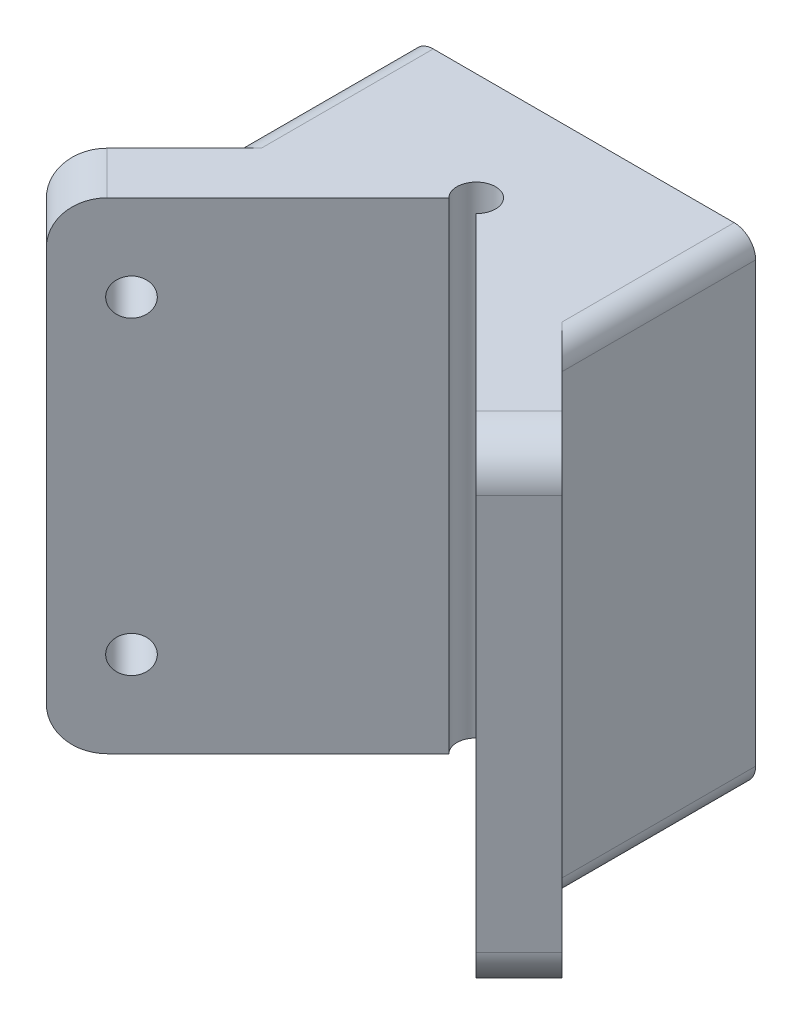
ISO-10303-21;
HEADER;
FILE_DESCRIPTION(('STEP AP214'),'2;1');
FILE_NAME('part.step','',(''),(''),'','','');
FILE_SCHEMA(('AUTOMOTIVE_DESIGN { 1 0 10303 214 1 1 1 1 }'));
ENDSEC;
DATA;
#1=APPLICATION_CONTEXT('core data for automotive mechanical design processes');
#2=APPLICATION_PROTOCOL_DEFINITION('international standard','automotive_design',2000,#1);
#3=PRODUCT_CONTEXT('',#1,'mechanical');
#4=PRODUCT('Part','Part','',(#3));
#5=PRODUCT_RELATED_PRODUCT_CATEGORY('part','',(#4));
#6=PRODUCT_DEFINITION_FORMATION('','',#4);
#7=PRODUCT_DEFINITION_CONTEXT('part definition',#1,'design');
#8=PRODUCT_DEFINITION('design','',#6,#7);
#9=PRODUCT_DEFINITION_SHAPE('','',#8);
#10=(LENGTH_UNIT() NAMED_UNIT(*) SI_UNIT(.MILLI.,.METRE.));
#11=(NAMED_UNIT(*) PLANE_ANGLE_UNIT() SI_UNIT($,.RADIAN.));
#12=(NAMED_UNIT(*) SI_UNIT($,.STERADIAN.) SOLID_ANGLE_UNIT());
#13=UNCERTAINTY_MEASURE_WITH_UNIT(LENGTH_MEASURE(1.E-05),#10,'distance_accuracy_value','');
#14=(GEOMETRIC_REPRESENTATION_CONTEXT(3) GLOBAL_UNCERTAINTY_ASSIGNED_CONTEXT((#13)) GLOBAL_UNIT_ASSIGNED_CONTEXT((#10,
#11,#12)) REPRESENTATION_CONTEXT('',''));
#15=CARTESIAN_POINT('',(0.,0.,0.));
#16=DIRECTION('',(0.,0.,1.));
#17=DIRECTION('',(1.,0.,0.));
#18=AXIS2_PLACEMENT_3D('',#15,#16,#17);
#19=CARTESIAN_POINT('',(40.,56.,100.));
#20=DIRECTION('',(-1.,0.,0.));
#21=DIRECTION('',(0.,0.,1.));
#22=AXIS2_PLACEMENT_3D('',#19,#20,#21);
#23=PLANE('',#22);
#24=DIRECTION('',(0.,1.,0.));
#25=VECTOR('',#24,1.);
#26=CARTESIAN_POINT('',(40.,56.,0.));
#27=LINE('',#26,#25);
#28=CARTESIAN_POINT('',(40.,-51.,0.));
#29=VERTEX_POINT('',#28);
#30=CARTESIAN_POINT('',(40.,51.,0.));
#31=VERTEX_POINT('',#30);
#32=EDGE_CURVE('E222',#29,#31,#27,.T.);
#33=ORIENTED_EDGE('',*,*,#32,.T.);
#34=DIRECTION('',(0.,0.,-1.));
#35=VECTOR('',#34,1.);
#36=CARTESIAN_POINT('',(40.,51.,100.));
#37=LINE('',#36,#35);
#38=CARTESIAN_POINT('',(40.,51.,45.0000000000003));
#39=VERTEX_POINT('',#38);
#40=EDGE_CURVE('E316',#31,#39,#37,.F.);
#41=ORIENTED_EDGE('',*,*,#40,.T.);
#42=DIRECTION('',(0.,-1.,0.));
#43=VECTOR('',#42,1.);
#44=CARTESIAN_POINT('',(40.,56.,45.0000000000003));
#45=LINE('',#44,#43);
#46=CARTESIAN_POINT('',(40.,-51.,45.0000000000003));
#47=VERTEX_POINT('',#46);
#48=EDGE_CURVE('E205',#39,#47,#45,.T.);
#49=ORIENTED_EDGE('',*,*,#48,.T.);
#50=DIRECTION('',(0.,0.,-1.));
#51=VECTOR('',#50,1.);
#52=CARTESIAN_POINT('',(40.,-51.,100.));
#53=LINE('',#52,#51);
#54=EDGE_CURVE('E313',#47,#29,#53,.T.);
#55=ORIENTED_EDGE('',*,*,#54,.T.);
#56=EDGE_LOOP('',(#33,#41,#49,#55));
#57=FACE_BOUND('',#56,.T.);
#58=ADVANCED_FACE('F33',(#57),#23,.F.);
#59=CARTESIAN_POINT('',(-40.,56.,100.));
#60=DIRECTION('',(0.,-1.,0.));
#61=DIRECTION('',(0.,0.,-1.));
#62=AXIS2_PLACEMENT_3D('',#59,#60,#61);
#63=PLANE('',#62);
#64=DIRECTION('',(-0.707106781186539,0.,0.707106781186556));
#65=VECTOR('',#64,1.);
#66=CARTESIAN_POINT('',(-50.,56.,74.9999999999997));
#67=LINE('',#66,#65);
#68=CARTESIAN_POINT('',(-3.18198051533943,56.,28.181980515338));
#69=VERTEX_POINT('',#68);
#70=CARTESIAN_POINT('',(-42.9289321881346,56.,67.9289321881342));
#71=VERTEX_POINT('',#70);
#72=EDGE_CURVE('E171',#69,#71,#67,.T.);
#73=ORIENTED_EDGE('',*,*,#72,.F.);
#74=CARTESIAN_POINT('',(0.,56.,24.9999999999985));
#75=DIRECTION('',(0.,1.,0.));
#76=DIRECTION('',(0.,0.,1.));
#77=AXIS2_PLACEMENT_3D('',#74,#75,#76);
#78=CIRCLE('',#77,4.5);
#79=CARTESIAN_POINT('',(3.1819805153395,56.,28.181980515338));
#80=VERTEX_POINT('',#79);
#81=EDGE_CURVE('E157',#80,#69,#78,.T.);
#82=ORIENTED_EDGE('',*,*,#81,.F.);
#83=DIRECTION('',(-0.707106781186556,0.,-0.707106781186539));
#84=VECTOR('',#83,1.);
#85=CARTESIAN_POINT('',(0.,56.,24.9999999999985));
#86=LINE('',#85,#84);
#87=CARTESIAN_POINT('',(42.9289321881356,56.,67.9289321881331));
#88=VERTEX_POINT('',#87);
#89=EDGE_CURVE('E168',#88,#80,#86,.T.);
#90=ORIENTED_EDGE('',*,*,#89,.F.);
#91=DIRECTION('',(0.707106781186545,0.,-0.70710678118655));
#92=VECTOR('',#91,1.);
#93=CARTESIAN_POINT('',(52.9289321881341,56.,57.9289321881346));
#94=LINE('',#93,#92);
#95=CARTESIAN_POINT('',(52.9289321881341,56.,57.9289321881345));
#96=VERTEX_POINT('',#95);
#97=EDGE_CURVE('E278',#88,#96,#94,.T.);
#98=ORIENTED_EDGE('',*,*,#97,.T.);
#99=DIRECTION('',(-0.707106781186545,0.,-0.70710678118655));
#100=VECTOR('',#99,1.);
#101=CARTESIAN_POINT('',(0.,56.,5.));
#102=LINE('',#101,#100);
#103=CARTESIAN_POINT('',(35.,56.,40.0000000000002));
#104=VERTEX_POINT('',#103);
#105=EDGE_CURVE('E191',#96,#104,#102,.T.);
#106=ORIENTED_EDGE('',*,*,#105,.T.);
#107=DIRECTION('',(0.,0.,-1.));
#108=VECTOR('',#107,1.);
#109=CARTESIAN_POINT('',(35.,56.,100.));
#110=LINE('',#109,#108);
#111=CARTESIAN_POINT('',(35.,56.,0.));
#112=VERTEX_POINT('',#111);
#113=EDGE_CURVE('E307',#104,#112,#110,.T.);
#114=ORIENTED_EDGE('',*,*,#113,.T.);
#115=DIRECTION('',(-1.,0.,0.));
#116=VECTOR('',#115,1.);
#117=CARTESIAN_POINT('',(-40.,56.,0.));
#118=LINE('',#117,#116);
#119=CARTESIAN_POINT('',(-35.,56.,0.));
#120=VERTEX_POINT('',#119);
#121=EDGE_CURVE('E225',#112,#120,#118,.T.);
#122=ORIENTED_EDGE('',*,*,#121,.T.);
#123=DIRECTION('',(0.,0.,-1.));
#124=VECTOR('',#123,1.);
#125=CARTESIAN_POINT('',(-35.,56.,100.));
#126=LINE('',#125,#124);
#127=CARTESIAN_POINT('',(-35.,56.,40.));
#128=VERTEX_POINT('',#127);
#129=EDGE_CURVE('E310',#120,#128,#126,.F.);
#130=ORIENTED_EDGE('',*,*,#129,.T.);
#131=DIRECTION('',(-0.707106781186547,0.,0.707106781186548));
#132=VECTOR('',#131,1.);
#133=CARTESIAN_POINT('',(-60.,56.,65.));
#134=LINE('',#133,#132);
#135=CARTESIAN_POINT('',(-52.9289321881345,56.,57.9289321881345));
#136=VERTEX_POINT('',#135);
#137=EDGE_CURVE('E196',#128,#136,#134,.T.);
#138=ORIENTED_EDGE('',*,*,#137,.T.);
#139=DIRECTION('',(0.707106781186556,0.,0.707106781186539));
#140=VECTOR('',#139,1.);
#141=CARTESIAN_POINT('',(-42.9289321881346,56.,67.9289321881342));
#142=LINE('',#141,#140);
#143=EDGE_CURVE('E276',#136,#71,#142,.T.);
#144=ORIENTED_EDGE('',*,*,#143,.T.);
#145=EDGE_LOOP('',(#73,#82,#90,#98,#106,#114,#122,#130,#138,#144));
#146=FACE_BOUND('',#145,.T.);
#147=ADVANCED_FACE('F166',(#146),#63,.F.);
#148=CARTESIAN_POINT('',(-40.,56.,100.));
#149=DIRECTION('',(1.,0.,0.));
#150=DIRECTION('',(0.,0.,-1.));
#151=AXIS2_PLACEMENT_3D('',#148,#149,#150);
#152=PLANE('',#151);
#153=DIRECTION('',(0.,1.,0.));
#154=VECTOR('',#153,1.);
#155=CARTESIAN_POINT('',(-40.,56.,45.));
#156=LINE('',#155,#154);
#157=CARTESIAN_POINT('',(-40.,-51.,45.));
#158=VERTEX_POINT('',#157);
#159=CARTESIAN_POINT('',(-40.,51.,45.));
#160=VERTEX_POINT('',#159);
#161=EDGE_CURVE('E215',#158,#160,#156,.T.);
#162=ORIENTED_EDGE('',*,*,#161,.T.);
#163=DIRECTION('',(0.,0.,-1.));
#164=VECTOR('',#163,1.);
#165=CARTESIAN_POINT('',(-40.,51.,100.));
#166=LINE('',#165,#164);
#167=CARTESIAN_POINT('',(-40.,51.,0.));
#168=VERTEX_POINT('',#167);
#169=EDGE_CURVE('E296',#160,#168,#166,.T.);
#170=ORIENTED_EDGE('',*,*,#169,.T.);
#171=DIRECTION('',(0.,-1.,0.));
#172=VECTOR('',#171,1.);
#173=CARTESIAN_POINT('',(-40.,56.,0.));
#174=LINE('',#173,#172);
#175=CARTESIAN_POINT('',(-40.,-51.,0.));
#176=VERTEX_POINT('',#175);
#177=EDGE_CURVE('E229',#168,#176,#174,.T.);
#178=ORIENTED_EDGE('',*,*,#177,.T.);
#179=DIRECTION('',(0.,0.,-1.));
#180=VECTOR('',#179,1.);
#181=CARTESIAN_POINT('',(-40.,-51.,100.));
#182=LINE('',#181,#180);
#183=EDGE_CURVE('E294',#176,#158,#182,.F.);
#184=ORIENTED_EDGE('',*,*,#183,.T.);
#185=EDGE_LOOP('',(#162,#170,#178,#184));
#186=FACE_BOUND('',#185,.T.);
#187=ADVANCED_FACE('F353',(#186),#152,.F.);
#188=CARTESIAN_POINT('',(-40.,-56.,100.));
#189=DIRECTION('',(0.,1.,0.));
#190=DIRECTION('',(0.,0.,1.));
#191=AXIS2_PLACEMENT_3D('',#188,#189,#190);
#192=PLANE('',#191);
#193=DIRECTION('',(-0.707106781186556,0.,-0.707106781186539));
#194=VECTOR('',#193,1.);
#195=CARTESIAN_POINT('',(0.,-56.,24.9999999999985));
#196=LINE('',#195,#194);
#197=CARTESIAN_POINT('',(42.9289321881356,-56.,67.9289321881331));
#198=VERTEX_POINT('',#197);
#199=CARTESIAN_POINT('',(3.1819805153395,-56.,28.181980515338));
#200=VERTEX_POINT('',#199);
#201=EDGE_CURVE('E179',#198,#200,#196,.T.);
#202=ORIENTED_EDGE('',*,*,#201,.T.);
#203=CARTESIAN_POINT('',(0.,-56.,24.9999999999985));
#204=DIRECTION('',(0.,1.,0.));
#205=DIRECTION('',(0.,0.,1.));
#206=AXIS2_PLACEMENT_3D('',#203,#204,#205);
#207=CIRCLE('',#206,4.5);
#208=CARTESIAN_POINT('',(-3.18198051533943,-56.,28.181980515338));
#209=VERTEX_POINT('',#208);
#210=EDGE_CURVE('E48',#200,#209,#207,.T.);
#211=ORIENTED_EDGE('',*,*,#210,.T.);
#212=DIRECTION('',(-0.707106781186539,0.,0.707106781186556));
#213=VECTOR('',#212,1.);
#214=CARTESIAN_POINT('',(-50.,-56.,74.9999999999997));
#215=LINE('',#214,#213);
#216=CARTESIAN_POINT('',(-42.9289321881346,-56.,67.9289321881342));
#217=VERTEX_POINT('',#216);
#218=EDGE_CURVE('E185',#209,#217,#215,.T.);
#219=ORIENTED_EDGE('',*,*,#218,.T.);
#220=DIRECTION('',(0.707106781186556,0.,0.707106781186539));
#221=VECTOR('',#220,1.);
#222=CARTESIAN_POINT('',(-52.9289321881346,-56.,57.9289321881344));
#223=LINE('',#222,#221);
#224=CARTESIAN_POINT('',(-52.9289321881345,-56.,57.9289321881345));
#225=VERTEX_POINT('',#224);
#226=EDGE_CURVE('E269',#217,#225,#223,.F.);
#227=ORIENTED_EDGE('',*,*,#226,.T.);
#228=DIRECTION('',(-0.707106781186547,0.,0.707106781186548));
#229=VECTOR('',#228,1.);
#230=CARTESIAN_POINT('',(-60.,-56.,65.));
#231=LINE('',#230,#229);
#232=CARTESIAN_POINT('',(-35.,-56.,40.));
#233=VERTEX_POINT('',#232);
#234=EDGE_CURVE('E55',#233,#225,#231,.T.);
#235=ORIENTED_EDGE('',*,*,#234,.F.);
#236=DIRECTION('',(0.,0.,-1.));
#237=VECTOR('',#236,1.);
#238=CARTESIAN_POINT('',(-35.,-56.,100.));
#239=LINE('',#238,#237);
#240=CARTESIAN_POINT('',(-35.,-56.,0.));
#241=VERTEX_POINT('',#240);
#242=EDGE_CURVE('E321',#233,#241,#239,.T.);
#243=ORIENTED_EDGE('',*,*,#242,.T.);
#244=DIRECTION('',(1.,0.,0.));
#245=VECTOR('',#244,1.);
#246=CARTESIAN_POINT('',(-40.,-56.,0.));
#247=LINE('',#246,#245);
#248=CARTESIAN_POINT('',(35.,-56.,0.));
#249=VERTEX_POINT('',#248);
#250=EDGE_CURVE('E232',#241,#249,#247,.T.);
#251=ORIENTED_EDGE('',*,*,#250,.T.);
#252=DIRECTION('',(0.,0.,-1.));
#253=VECTOR('',#252,1.);
#254=CARTESIAN_POINT('',(35.,-56.,100.));
#255=LINE('',#254,#253);
#256=CARTESIAN_POINT('',(35.,-56.,40.0000000000002));
#257=VERTEX_POINT('',#256);
#258=EDGE_CURVE('E318',#249,#257,#255,.F.);
#259=ORIENTED_EDGE('',*,*,#258,.T.);
#260=DIRECTION('',(-0.707106781186545,0.,-0.70710678118655));
#261=VECTOR('',#260,1.);
#262=CARTESIAN_POINT('',(0.,-56.,5.));
#263=LINE('',#262,#261);
#264=CARTESIAN_POINT('',(52.9289321881341,-56.,57.9289321881345));
#265=VERTEX_POINT('',#264);
#266=EDGE_CURVE('E194',#265,#257,#263,.T.);
#267=ORIENTED_EDGE('',*,*,#266,.F.);
#268=DIRECTION('',(0.707106781186545,0.,-0.70710678118655));
#269=VECTOR('',#268,1.);
#270=CARTESIAN_POINT('',(42.9289321881369,-56.,67.9289321881318));
#271=LINE('',#270,#269);
#272=EDGE_CURVE('E271',#265,#198,#271,.F.);
#273=ORIENTED_EDGE('',*,*,#272,.T.);
#274=EDGE_LOOP('',(#202,#211,#219,#227,#235,#243,#251,#259,#267,#273));
#275=FACE_BOUND('',#274,.T.);
#276=ADVANCED_FACE('F346',(#275),#192,.F.);
#277=CARTESIAN_POINT('',(0.,0.,0.));
#278=DIRECTION('',(0.,0.,1.));
#279=DIRECTION('',(1.,0.,0.));
#280=AXIS2_PLACEMENT_3D('',#277,#278,#279);
#281=PLANE('',#280);
#282=CARTESIAN_POINT('',(32.,-48.,0.));
#283=DIRECTION('',(0.,0.,1.));
#284=DIRECTION('',(1.,0.,0.));
#285=AXIS2_PLACEMENT_3D('',#282,#283,#284);
#286=CIRCLE('',#285,2.5);
#287=CARTESIAN_POINT('',(34.5,-48.,0.));
#288=VERTEX_POINT('',#287);
#289=EDGE_CURVE('E226',#288,#288,#286,.F.);
#290=ORIENTED_EDGE('',*,*,#289,.F.);
#291=EDGE_LOOP('',(#290));
#292=FACE_BOUND('',#291,.T.);
#293=CARTESIAN_POINT('',(-32.,47.9976581795832,0.));
#294=DIRECTION('',(0.,0.,1.));
#295=DIRECTION('',(1.,0.,0.));
#296=AXIS2_PLACEMENT_3D('',#293,#294,#295);
#297=CIRCLE('',#296,2.5);
#298=CARTESIAN_POINT('',(-29.5,47.9976581795832,0.));
#299=VERTEX_POINT('',#298);
#300=EDGE_CURVE('E241',#299,#299,#297,.F.);
#301=ORIENTED_EDGE('',*,*,#300,.F.);
#302=EDGE_LOOP('',(#301));
#303=FACE_BOUND('',#302,.T.);
#304=CARTESIAN_POINT('',(32.,48.,0.));
#305=DIRECTION('',(0.,0.,1.));
#306=DIRECTION('',(1.,0.,0.));
#307=AXIS2_PLACEMENT_3D('',#304,#305,#306);
#308=CIRCLE('',#307,2.5);
#309=CARTESIAN_POINT('',(34.5,48.,0.));
#310=VERTEX_POINT('',#309);
#311=EDGE_CURVE('E238',#310,#310,#308,.F.);
#312=ORIENTED_EDGE('',*,*,#311,.F.);
#313=EDGE_LOOP('',(#312));
#314=FACE_BOUND('',#313,.T.);
#315=CARTESIAN_POINT('',(-32.,-48.,0.));
#316=DIRECTION('',(0.,0.,1.));
#317=DIRECTION('',(1.,0.,0.));
#318=AXIS2_PLACEMENT_3D('',#315,#316,#317);
#319=CIRCLE('',#318,2.5);
#320=CARTESIAN_POINT('',(-29.5,-48.,0.));
#321=VERTEX_POINT('',#320);
#322=EDGE_CURVE('E221',#321,#321,#319,.F.);
#323=ORIENTED_EDGE('',*,*,#322,.F.);
#324=EDGE_LOOP('',(#323));
#325=FACE_BOUND('',#324,.T.);
#326=ORIENTED_EDGE('',*,*,#177,.F.);
#327=CARTESIAN_POINT('',(-35.,51.,0.));
#328=DIRECTION('',(0.,0.,1.));
#329=DIRECTION('',(1.,0.,0.));
#330=AXIS2_PLACEMENT_3D('',#327,#328,#329);
#331=CIRCLE('',#330,5.);
#332=EDGE_CURVE('E305',#168,#120,#331,.F.);
#333=ORIENTED_EDGE('',*,*,#332,.T.);
#334=ORIENTED_EDGE('',*,*,#121,.F.);
#335=CARTESIAN_POINT('',(35.,51.,0.));
#336=DIRECTION('',(0.,0.,1.));
#337=DIRECTION('',(1.,0.,0.));
#338=AXIS2_PLACEMENT_3D('',#335,#336,#337);
#339=CIRCLE('',#338,5.);
#340=EDGE_CURVE('E303',#112,#31,#339,.F.);
#341=ORIENTED_EDGE('',*,*,#340,.T.);
#342=ORIENTED_EDGE('',*,*,#32,.F.);
#343=CARTESIAN_POINT('',(35.,-51.,0.));
#344=DIRECTION('',(0.,0.,1.));
#345=DIRECTION('',(1.,0.,0.));
#346=AXIS2_PLACEMENT_3D('',#343,#344,#345);
#347=CIRCLE('',#346,5.);
#348=EDGE_CURVE('E299',#29,#249,#347,.F.);
#349=ORIENTED_EDGE('',*,*,#348,.T.);
#350=ORIENTED_EDGE('',*,*,#250,.F.);
#351=CARTESIAN_POINT('',(-35.,-51.,0.));
#352=DIRECTION('',(0.,0.,1.));
#353=DIRECTION('',(1.,0.,0.));
#354=AXIS2_PLACEMENT_3D('',#351,#352,#353);
#355=CIRCLE('',#354,5.);
#356=EDGE_CURVE('E301',#241,#176,#355,.F.);
#357=ORIENTED_EDGE('',*,*,#356,.T.);
#358=EDGE_LOOP('',(#326,#333,#334,#341,#342,#349,#350,#357));
#359=FACE_BOUND('',#358,.T.);
#360=ADVANCED_FACE('F345',(#292,#303,#314,#325,#359),#281,.F.);
#361=CARTESIAN_POINT('',(-32.,-48.,107.071067811865));
#362=DIRECTION('',(0.,0.,-1.));
#363=DIRECTION('',(-1.,0.,0.));
#364=AXIS2_PLACEMENT_3D('',#361,#362,#363);
#365=CYLINDRICAL_SURFACE('',#364,2.5);
#366=CARTESIAN_POINT('',(-32.,-48.,37.));
#367=DIRECTION('',(-0.707106781186548,0.,-0.707106781186547));
#368=DIRECTION('',(0.707106781186547,0.,-0.707106781186548));
#369=AXIS2_PLACEMENT_3D('',#366,#367,#368);
#370=ELLIPSE('',#369,3.53553390593274,2.5);
#371=CARTESIAN_POINT('',(-29.5,-48.,34.5));
#372=VERTEX_POINT('',#371);
#373=EDGE_CURVE('E211',#372,#372,#370,.T.);
#374=ORIENTED_EDGE('',*,*,#373,.F.);
#375=EDGE_LOOP('',(#374));
#376=FACE_BOUND('',#375,.T.);
#377=ORIENTED_EDGE('',*,*,#322,.T.);
#378=EDGE_LOOP('',(#377));
#379=FACE_BOUND('',#378,.T.);
#380=ADVANCED_FACE('F399',(#376,#379),#365,.F.);
#381=CARTESIAN_POINT('',(32.,48.,107.071067811865));
#382=DIRECTION('',(0.,0.,-1.));
#383=DIRECTION('',(-1.,0.,0.));
#384=AXIS2_PLACEMENT_3D('',#381,#382,#383);
#385=CYLINDRICAL_SURFACE('',#384,2.5);
#386=CARTESIAN_POINT('',(32.,48.,37.0000000000002));
#387=DIRECTION('',(0.70710678118655,0.,-0.707106781186545));
#388=DIRECTION('',(-0.707106781186545,0.,-0.70710678118655));
#389=AXIS2_PLACEMENT_3D('',#386,#387,#388);
#390=ELLIPSE('',#389,3.53553390593275,2.5);
#391=CARTESIAN_POINT('',(29.5,48.,34.5000000000002));
#392=VERTEX_POINT('',#391);
#393=EDGE_CURVE('E208',#392,#392,#390,.T.);
#394=ORIENTED_EDGE('',*,*,#393,.F.);
#395=EDGE_LOOP('',(#394));
#396=FACE_BOUND('',#395,.T.);
#397=ORIENTED_EDGE('',*,*,#311,.T.);
#398=EDGE_LOOP('',(#397));
#399=FACE_BOUND('',#398,.T.);
#400=ADVANCED_FACE('F403',(#396,#399),#385,.F.);
#401=CARTESIAN_POINT('',(-32.,47.9976581795832,107.071067811865));
#402=DIRECTION('',(0.,0.,-1.));
#403=DIRECTION('',(-1.,0.,0.));
#404=AXIS2_PLACEMENT_3D('',#401,#402,#403);
#405=CYLINDRICAL_SURFACE('',#404,2.5);
#406=CARTESIAN_POINT('',(-32.,47.9976581795832,37.));
#407=DIRECTION('',(-0.707106781186548,0.,-0.707106781186547));
#408=DIRECTION('',(0.707106781186547,0.,-0.707106781186548));
#409=AXIS2_PLACEMENT_3D('',#406,#407,#408);
#410=ELLIPSE('',#409,3.53553390593274,2.5);
#411=CARTESIAN_POINT('',(-29.5,47.9976581795832,34.5));
#412=VERTEX_POINT('',#411);
#413=EDGE_CURVE('E212',#412,#412,#410,.T.);
#414=ORIENTED_EDGE('',*,*,#413,.F.);
#415=EDGE_LOOP('',(#414));
#416=FACE_BOUND('',#415,.T.);
#417=ORIENTED_EDGE('',*,*,#300,.T.);
#418=EDGE_LOOP('',(#417));
#419=FACE_BOUND('',#418,.T.);
#420=ADVANCED_FACE('F409',(#416,#419),#405,.F.);
#421=CARTESIAN_POINT('',(32.,-48.,107.071067811865));
#422=DIRECTION('',(0.,0.,-1.));
#423=DIRECTION('',(-1.,0.,0.));
#424=AXIS2_PLACEMENT_3D('',#421,#422,#423);
#425=CYLINDRICAL_SURFACE('',#424,2.5);
#426=CARTESIAN_POINT('',(32.,-48.,37.0000000000002));
#427=DIRECTION('',(0.70710678118655,0.,-0.707106781186545));
#428=DIRECTION('',(-0.707106781186545,0.,-0.70710678118655));
#429=AXIS2_PLACEMENT_3D('',#426,#427,#428);
#430=ELLIPSE('',#429,3.53553390593275,2.5);
#431=CARTESIAN_POINT('',(29.5,-48.,34.5000000000002));
#432=VERTEX_POINT('',#431);
#433=EDGE_CURVE('E235',#432,#432,#430,.T.);
#434=ORIENTED_EDGE('',*,*,#433,.F.);
#435=EDGE_LOOP('',(#434));
#436=FACE_BOUND('',#435,.T.);
#437=ORIENTED_EDGE('',*,*,#289,.T.);
#438=EDGE_LOOP('',(#437));
#439=FACE_BOUND('',#438,.T.);
#440=ADVANCED_FACE('F405',(#436,#439),#425,.F.);
#441=CARTESIAN_POINT('',(0.,-56.,5.));
#442=DIRECTION('',(0.70710678118655,0.,-0.707106781186545));
#443=DIRECTION('',(-0.707106781186545,0.,-0.70710678118655));
#444=AXIS2_PLACEMENT_3D('',#441,#442,#443);
#445=PLANE('',#444);
#446=ORIENTED_EDGE('',*,*,#433,.T.);
#447=EDGE_LOOP('',(#446));
#448=FACE_BOUND('',#447,.T.);
#449=ADVANCED_FACE('F408',(#448),#445,.T.);
#450=CARTESIAN_POINT('',(-60.,-56.,65.));
#451=DIRECTION('',(-0.707106781186548,0.,-0.707106781186547));
#452=DIRECTION('',(-0.707106781186547,0.,0.707106781186548));
#453=AXIS2_PLACEMENT_3D('',#450,#451,#452);
#454=PLANE('',#453);
#455=ORIENTED_EDGE('',*,*,#413,.T.);
#456=EDGE_LOOP('',(#455));
#457=FACE_BOUND('',#456,.T.);
#458=ADVANCED_FACE('F427',(#457),#454,.T.);
#459=ORIENTED_EDGE('',*,*,#393,.T.);
#460=EDGE_LOOP('',(#459));
#461=FACE_BOUND('',#460,.T.);
#462=ADVANCED_FACE('F422',(#461),#445,.T.);
#463=ORIENTED_EDGE('',*,*,#373,.T.);
#464=EDGE_LOOP('',(#463));
#465=FACE_BOUND('',#464,.T.);
#466=ADVANCED_FACE('F425',(#465),#454,.T.);
#467=CARTESIAN_POINT('',(-50.1005050633883,36.,55.1005050633883));
#468=DIRECTION('',(-0.707106781186548,0.,-0.707106781186547));
#469=DIRECTION('',(-0.707106781186547,0.,0.707106781186548));
#470=AXIS2_PLACEMENT_3D('',#467,#468,#469);
#471=CIRCLE('',#470,4.25000000000001);
#472=CARTESIAN_POINT('',(-53.1057088834311,36.,58.1057088834312));
#473=VERTEX_POINT('',#472);
#474=EDGE_CURVE('E251',#473,#473,#471,.T.);
#475=ORIENTED_EDGE('',*,*,#474,.F.);
#476=EDGE_LOOP('',(#475));
#477=FACE_BOUND('',#476,.T.);
#478=CARTESIAN_POINT('',(-50.1005050633883,-36.,55.1005050633883));
#479=DIRECTION('',(-0.707106781186548,0.,-0.707106781186547));
#480=DIRECTION('',(-0.707106781186547,0.,0.707106781186548));
#481=AXIS2_PLACEMENT_3D('',#478,#479,#480);
#482=CIRCLE('',#481,4.25000000000001);
#483=CARTESIAN_POINT('',(-53.1057088834312,-36.,58.1057088834312));
#484=VERTEX_POINT('',#483);
#485=EDGE_CURVE('E260',#484,#484,#482,.T.);
#486=ORIENTED_EDGE('',*,*,#485,.F.);
#487=EDGE_LOOP('',(#486));
#488=FACE_BOUND('',#487,.T.);
#489=ORIENTED_EDGE('',*,*,#234,.T.);
#490=CARTESIAN_POINT('',(-52.9289321881345,-46.,57.9289321881345));
#491=DIRECTION('',(-0.707106781186548,0.,-0.707106781186547));
#492=DIRECTION('',(-0.707106781186547,0.,0.707106781186548));
#493=AXIS2_PLACEMENT_3D('',#490,#491,#492);
#494=CIRCLE('',#493,10.);
#495=CARTESIAN_POINT('',(-60.,-46.,65.));
#496=VERTEX_POINT('',#495);
#497=EDGE_CURVE('E292',#225,#496,#494,.T.);
#498=ORIENTED_EDGE('',*,*,#497,.T.);
#499=DIRECTION('',(0.,1.,0.));
#500=VECTOR('',#499,1.);
#501=CARTESIAN_POINT('',(-60.,-56.,65.));
#502=LINE('',#501,#500);
#503=CARTESIAN_POINT('',(-60.,46.,65.));
#504=VERTEX_POINT('',#503);
#505=EDGE_CURVE('E202',#496,#504,#502,.T.);
#506=ORIENTED_EDGE('',*,*,#505,.T.);
#507=CARTESIAN_POINT('',(-52.9289321881345,46.,57.9289321881345));
#508=DIRECTION('',(-0.707106781186548,0.,-0.707106781186547));
#509=DIRECTION('',(-0.707106781186547,0.,0.707106781186548));
#510=AXIS2_PLACEMENT_3D('',#507,#508,#509);
#511=CIRCLE('',#510,10.);
#512=EDGE_CURVE('E290',#504,#136,#511,.T.);
#513=ORIENTED_EDGE('',*,*,#512,.T.);
#514=ORIENTED_EDGE('',*,*,#137,.F.);
#515=CARTESIAN_POINT('',(-35.,51.,40.));
#516=DIRECTION('',(-0.707106781186548,0.,-0.707106781186547));
#517=DIRECTION('',(0.707106781186547,0.,-0.707106781186548));
#518=AXIS2_PLACEMENT_3D('',#515,#516,#517);
#519=ELLIPSE('',#518,7.07106781186548,5.);
#520=EDGE_CURVE('E323',#128,#160,#519,.F.);
#521=ORIENTED_EDGE('',*,*,#520,.T.);
#522=ORIENTED_EDGE('',*,*,#161,.F.);
#523=CARTESIAN_POINT('',(-35.,-51.,40.));
#524=DIRECTION('',(-0.707106781186548,0.,-0.707106781186547));
#525=DIRECTION('',(0.707106781186547,0.,-0.707106781186548));
#526=AXIS2_PLACEMENT_3D('',#523,#524,#525);
#527=ELLIPSE('',#526,7.07106781186548,5.);
#528=EDGE_CURVE('E328',#158,#233,#527,.F.);
#529=ORIENTED_EDGE('',*,*,#528,.T.);
#530=EDGE_LOOP('',(#489,#498,#506,#513,#514,#521,#522,#529));
#531=FACE_BOUND('',#530,.T.);
#532=ADVANCED_FACE('F420',(#477,#488,#531),#454,.T.);
#533=CARTESIAN_POINT('',(50.1005050633879,-36.,55.1005050633883));
#534=DIRECTION('',(0.70710678118655,0.,-0.707106781186545));
#535=DIRECTION('',(-0.707106781186545,0.,-0.70710678118655));
#536=AXIS2_PLACEMENT_3D('',#533,#534,#535);
#537=CIRCLE('',#536,4.25000000000001);
#538=CARTESIAN_POINT('',(47.0953012433451,-36.,52.0953012433454));
#539=VERTEX_POINT('',#538);
#540=EDGE_CURVE('E257',#539,#539,#537,.T.);
#541=ORIENTED_EDGE('',*,*,#540,.F.);
#542=EDGE_LOOP('',(#541));
#543=FACE_BOUND('',#542,.T.);
#544=CARTESIAN_POINT('',(50.100505063388,36.,55.1005050633883));
#545=DIRECTION('',(0.70710678118655,0.,-0.707106781186545));
#546=DIRECTION('',(-0.707106781186545,0.,-0.70710678118655));
#547=AXIS2_PLACEMENT_3D('',#544,#545,#546);
#548=CIRCLE('',#547,4.25000000000001);
#549=CARTESIAN_POINT('',(47.0953012433451,36.,52.0953012433455));
#550=VERTEX_POINT('',#549);
#551=EDGE_CURVE('E486',#550,#550,#548,.T.);
#552=ORIENTED_EDGE('',*,*,#551,.F.);
#553=EDGE_LOOP('',(#552));
#554=FACE_BOUND('',#553,.T.);
#555=DIRECTION('',(0.,1.,0.));
#556=VECTOR('',#555,1.);
#557=CARTESIAN_POINT('',(59.9999999999996,-56.,65.));
#558=LINE('',#557,#556);
#559=CARTESIAN_POINT('',(59.9999999999996,-46.,65.));
#560=VERTEX_POINT('',#559);
#561=CARTESIAN_POINT('',(59.9999999999996,46.,65.));
#562=VERTEX_POINT('',#561);
#563=EDGE_CURVE('E198',#560,#562,#558,.T.);
#564=ORIENTED_EDGE('',*,*,#563,.F.);
#565=CARTESIAN_POINT('',(52.9289321881341,-46.,57.9289321881345));
#566=DIRECTION('',(0.70710678118655,0.,-0.707106781186545));
#567=DIRECTION('',(-0.707106781186545,0.,-0.70710678118655));
#568=AXIS2_PLACEMENT_3D('',#565,#566,#567);
#569=CIRCLE('',#568,10.);
#570=EDGE_CURVE('E267',#560,#265,#569,.T.);
#571=ORIENTED_EDGE('',*,*,#570,.T.);
#572=ORIENTED_EDGE('',*,*,#266,.T.);
#573=CARTESIAN_POINT('',(35.,-51.,40.0000000000002));
#574=DIRECTION('',(0.70710678118655,0.,-0.707106781186545));
#575=DIRECTION('',(-0.707106781186545,0.,-0.70710678118655));
#576=AXIS2_PLACEMENT_3D('',#573,#574,#575);
#577=ELLIPSE('',#576,7.0710678118655,5.);
#578=EDGE_CURVE('E41',#257,#47,#577,.F.);
#579=ORIENTED_EDGE('',*,*,#578,.T.);
#580=ORIENTED_EDGE('',*,*,#48,.F.);
#581=CARTESIAN_POINT('',(35.,51.,40.0000000000002));
#582=DIRECTION('',(0.70710678118655,0.,-0.707106781186545));
#583=DIRECTION('',(-0.707106781186545,0.,-0.70710678118655));
#584=AXIS2_PLACEMENT_3D('',#581,#582,#583);
#585=ELLIPSE('',#584,7.0710678118655,5.);
#586=EDGE_CURVE('E325',#39,#104,#585,.F.);
#587=ORIENTED_EDGE('',*,*,#586,.T.);
#588=ORIENTED_EDGE('',*,*,#105,.F.);
#589=CARTESIAN_POINT('',(52.9289321881341,46.,57.9289321881345));
#590=DIRECTION('',(0.70710678118655,0.,-0.707106781186545));
#591=DIRECTION('',(-0.707106781186545,0.,-0.70710678118655));
#592=AXIS2_PLACEMENT_3D('',#589,#590,#591);
#593=CIRCLE('',#592,10.);
#594=EDGE_CURVE('E265',#96,#562,#593,.T.);
#595=ORIENTED_EDGE('',*,*,#594,.T.);
#596=EDGE_LOOP('',(#564,#571,#572,#579,#580,#587,#588,#595));
#597=FACE_BOUND('',#596,.T.);
#598=ADVANCED_FACE('F333',(#543,#554,#597),#445,.T.);
#599=CARTESIAN_POINT('',(-60.,-56.,65.));
#600=DIRECTION('',(-0.707106781186539,0.,0.707106781186556));
#601=DIRECTION('',(0.707106781186556,0.,0.707106781186539));
#602=AXIS2_PLACEMENT_3D('',#599,#600,#601);
#603=PLANE('',#602);
#604=ORIENTED_EDGE('',*,*,#505,.F.);
#605=DIRECTION('',(0.707106781186556,0.,0.707106781186539));
#606=VECTOR('',#605,1.);
#607=CARTESIAN_POINT('',(-50.,-46.,74.9999999999997));
#608=LINE('',#607,#606);
#609=CARTESIAN_POINT('',(-50.,-46.,74.9999999999997));
#610=VERTEX_POINT('',#609);
#611=EDGE_CURVE('E282',#496,#610,#608,.T.);
#612=ORIENTED_EDGE('',*,*,#611,.T.);
#613=DIRECTION('',(0.,1.,0.));
#614=VECTOR('',#613,1.);
#615=CARTESIAN_POINT('',(-50.,-56.,74.9999999999997));
#616=LINE('',#615,#614);
#617=CARTESIAN_POINT('',(-50.,46.,74.9999999999997));
#618=VERTEX_POINT('',#617);
#619=EDGE_CURVE('E188',#610,#618,#616,.T.);
#620=ORIENTED_EDGE('',*,*,#619,.T.);
#621=DIRECTION('',(0.707106781186556,0.,0.707106781186539));
#622=VECTOR('',#621,1.);
#623=CARTESIAN_POINT('',(-60.,46.,65.));
#624=LINE('',#623,#622);
#625=EDGE_CURVE('E280',#618,#504,#624,.F.);
#626=ORIENTED_EDGE('',*,*,#625,.T.);
#627=EDGE_LOOP('',(#604,#612,#620,#626));
#628=FACE_BOUND('',#627,.T.);
#629=ADVANCED_FACE('F419',(#628),#603,.T.);
#630=CARTESIAN_POINT('',(59.9999999999996,-56.,65.));
#631=DIRECTION('',(0.70710678118655,0.,0.707106781186545));
#632=DIRECTION('',(0.707106781186545,0.,-0.70710678118655));
#633=AXIS2_PLACEMENT_3D('',#630,#631,#632);
#634=PLANE('',#633);
#635=DIRECTION('',(0.,1.,0.));
#636=VECTOR('',#635,1.);
#637=CARTESIAN_POINT('',(50.0000000000024,-56.,74.9999999999997));
#638=LINE('',#637,#636);
#639=CARTESIAN_POINT('',(50.0000000000024,-46.,74.9999999999997));
#640=VERTEX_POINT('',#639);
#641=CARTESIAN_POINT('',(50.0000000000024,46.,74.9999999999997));
#642=VERTEX_POINT('',#641);
#643=EDGE_CURVE('E192',#640,#642,#638,.T.);
#644=ORIENTED_EDGE('',*,*,#643,.F.);
#645=DIRECTION('',(0.707106781186545,0.,-0.70710678118655));
#646=VECTOR('',#645,1.);
#647=CARTESIAN_POINT('',(59.9999999999996,-46.,65.));
#648=LINE('',#647,#646);
#649=EDGE_CURVE('E262',#640,#560,#648,.T.);
#650=ORIENTED_EDGE('',*,*,#649,.T.);
#651=ORIENTED_EDGE('',*,*,#563,.T.);
#652=DIRECTION('',(0.707106781186545,0.,-0.70710678118655));
#653=VECTOR('',#652,1.);
#654=CARTESIAN_POINT('',(50.0000000000012,46.,74.9999999999985));
#655=LINE('',#654,#653);
#656=EDGE_CURVE('E218',#562,#642,#655,.F.);
#657=ORIENTED_EDGE('',*,*,#656,.T.);
#658=EDGE_LOOP('',(#644,#650,#651,#657));
#659=FACE_BOUND('',#658,.T.);
#660=ADVANCED_FACE('F369',(#659),#634,.T.);
#661=CARTESIAN_POINT('',(-50.,-56.,74.9999999999997));
#662=DIRECTION('',(-0.707106781186556,0.,-0.707106781186539));
#663=DIRECTION('',(-0.707106781186539,0.,0.707106781186556));
#664=AXIS2_PLACEMENT_3D('',#661,#662,#663);
#665=PLANE('',#664);
#666=CARTESIAN_POINT('',(-40.1005050633886,36.,65.1005050633881));
#667=DIRECTION('',(-0.707106781186556,0.,-0.707106781186539));
#668=DIRECTION('',(-0.707106781186539,0.,0.707106781186556));
#669=AXIS2_PLACEMENT_3D('',#666,#667,#668);
#670=CIRCLE('',#669,4.25000000000001);
#671=CARTESIAN_POINT('',(-43.1057088834314,36.,68.1057088834309));
#672=VERTEX_POINT('',#671);
#673=EDGE_CURVE('E177',#672,#672,#670,.T.);
#674=ORIENTED_EDGE('',*,*,#673,.T.);
#675=EDGE_LOOP('',(#674));
#676=FACE_BOUND('',#675,.T.);
#677=CARTESIAN_POINT('',(-40.1005050633886,-36.,65.1005050633881));
#678=DIRECTION('',(-0.707106781186556,0.,-0.707106781186539));
#679=DIRECTION('',(-0.707106781186539,0.,0.707106781186556));
#680=AXIS2_PLACEMENT_3D('',#677,#678,#679);
#681=CIRCLE('',#680,4.25000000000001);
#682=CARTESIAN_POINT('',(-43.1057088834314,-36.,68.1057088834309));
#683=VERTEX_POINT('',#682);
#684=EDGE_CURVE('E182',#683,#683,#681,.T.);
#685=ORIENTED_EDGE('',*,*,#684,.T.);
#686=EDGE_LOOP('',(#685));
#687=FACE_BOUND('',#686,.T.);
#688=ORIENTED_EDGE('',*,*,#218,.F.);
#689=DIRECTION('',(0.,1.,0.));
#690=VECTOR('',#689,1.);
#691=CARTESIAN_POINT('',(-3.18198051533943,-56.,28.181980515338));
#692=LINE('',#691,#690);
#693=EDGE_CURVE('E485',#209,#69,#692,.T.);
#694=ORIENTED_EDGE('',*,*,#693,.T.);
#695=ORIENTED_EDGE('',*,*,#72,.T.);
#696=CARTESIAN_POINT('',(-42.9289321881346,46.,67.9289321881342));
#697=DIRECTION('',(-0.707106781186556,0.,-0.707106781186539));
#698=DIRECTION('',(-0.707106781186539,0.,0.707106781186556));
#699=AXIS2_PLACEMENT_3D('',#696,#697,#698);
#700=CIRCLE('',#699,10.);
#701=EDGE_CURVE('E285',#71,#618,#700,.F.);
#702=ORIENTED_EDGE('',*,*,#701,.T.);
#703=ORIENTED_EDGE('',*,*,#619,.F.);
#704=CARTESIAN_POINT('',(-42.9289321881346,-46.,67.9289321881342));
#705=DIRECTION('',(-0.707106781186556,0.,-0.707106781186539));
#706=DIRECTION('',(-0.707106781186539,0.,0.707106781186556));
#707=AXIS2_PLACEMENT_3D('',#704,#705,#706);
#708=CIRCLE('',#707,10.);
#709=EDGE_CURVE('E287',#610,#217,#708,.F.);
#710=ORIENTED_EDGE('',*,*,#709,.T.);
#711=EDGE_LOOP('',(#688,#694,#695,#702,#703,#710));
#712=FACE_BOUND('',#711,.T.);
#713=ADVANCED_FACE('F433',(#676,#687,#712),#665,.F.);
#714=CARTESIAN_POINT('',(0.,-56.,24.9999999999985));
#715=DIRECTION('',(0.707106781186539,0.,-0.707106781186556));
#716=DIRECTION('',(-0.707106781186556,0.,-0.707106781186539));
#717=AXIS2_PLACEMENT_3D('',#714,#715,#716);
#718=PLANE('',#717);
#719=CARTESIAN_POINT('',(40.1005050633893,-36.,65.1005050633869));
#720=DIRECTION('',(0.707106781186539,0.,-0.707106781186556));
#721=DIRECTION('',(-0.707106781186556,0.,-0.707106781186539));
#722=AXIS2_PLACEMENT_3D('',#719,#720,#721);
#723=CIRCLE('',#722,4.25000000000001);
#724=CARTESIAN_POINT('',(37.0953012433464,-36.,62.0953012433441));
#725=VERTEX_POINT('',#724);
#726=EDGE_CURVE('E256',#725,#725,#723,.T.);
#727=ORIENTED_EDGE('',*,*,#726,.T.);
#728=EDGE_LOOP('',(#727));
#729=FACE_BOUND('',#728,.T.);
#730=CARTESIAN_POINT('',(40.1005050633893,36.,65.1005050633869));
#731=DIRECTION('',(0.707106781186539,0.,-0.707106781186556));
#732=DIRECTION('',(-0.707106781186556,0.,-0.707106781186539));
#733=AXIS2_PLACEMENT_3D('',#730,#731,#732);
#734=CIRCLE('',#733,4.25000000000001);
#735=CARTESIAN_POINT('',(37.0953012433465,36.,62.0953012433441));
#736=VERTEX_POINT('',#735);
#737=EDGE_CURVE('E253',#736,#736,#734,.T.);
#738=ORIENTED_EDGE('',*,*,#737,.T.);
#739=EDGE_LOOP('',(#738));
#740=FACE_BOUND('',#739,.T.);
#741=ORIENTED_EDGE('',*,*,#89,.T.);
#742=DIRECTION('',(0.,1.,0.));
#743=VECTOR('',#742,1.);
#744=CARTESIAN_POINT('',(3.1819805153395,-56.,28.181980515338));
#745=LINE('',#744,#743);
#746=EDGE_CURVE('E11',#80,#200,#745,.F.);
#747=ORIENTED_EDGE('',*,*,#746,.T.);
#748=ORIENTED_EDGE('',*,*,#201,.F.);
#749=CARTESIAN_POINT('',(42.9289321881356,-46.,67.9289321881331));
#750=DIRECTION('',(0.707106781186539,0.,-0.707106781186556));
#751=DIRECTION('',(-0.707106781186556,0.,-0.707106781186539));
#752=AXIS2_PLACEMENT_3D('',#749,#750,#751);
#753=CIRCLE('',#752,10.);
#754=EDGE_CURVE('E274',#198,#640,#753,.F.);
#755=ORIENTED_EDGE('',*,*,#754,.T.);
#756=ORIENTED_EDGE('',*,*,#643,.T.);
#757=CARTESIAN_POINT('',(42.9289321881356,46.,67.9289321881331));
#758=DIRECTION('',(0.707106781186539,0.,-0.707106781186556));
#759=DIRECTION('',(-0.707106781186556,0.,-0.707106781186539));
#760=AXIS2_PLACEMENT_3D('',#757,#758,#759);
#761=CIRCLE('',#760,10.);
#762=EDGE_CURVE('E176',#642,#88,#761,.F.);
#763=ORIENTED_EDGE('',*,*,#762,.T.);
#764=EDGE_LOOP('',(#741,#747,#748,#755,#756,#763));
#765=FACE_BOUND('',#764,.T.);
#766=ADVANCED_FACE('F173',(#729,#740,#765),#718,.F.);
#767=CARTESIAN_POINT('',(29.095454429505,-36.,134.296464556282));
#768=DIRECTION('',(-0.707106781186548,0.,-0.707106781186547));
#769=DIRECTION('',(-0.707106781186547,0.,0.707106781186548));
#770=AXIS2_PLACEMENT_3D('',#767,#768,#769);
#771=CYLINDRICAL_SURFACE('',#770,4.25000000000001);
#772=ORIENTED_EDGE('',*,*,#485,.T.);
#773=EDGE_LOOP('',(#772));
#774=FACE_BOUND('',#773,.T.);
#775=ORIENTED_EDGE('',*,*,#684,.F.);
#776=EDGE_LOOP('',(#775));
#777=FACE_BOUND('',#776,.T.);
#778=ADVANCED_FACE('F436',(#774,#777),#771,.F.);
#779=CARTESIAN_POINT('',(29.095454429505,36.,134.296464556282));
#780=DIRECTION('',(-0.707106781186548,0.,-0.707106781186547));
#781=DIRECTION('',(-0.707106781186547,0.,0.707106781186548));
#782=AXIS2_PLACEMENT_3D('',#779,#780,#781);
#783=CYLINDRICAL_SURFACE('',#782,4.25000000000001);
#784=ORIENTED_EDGE('',*,*,#474,.T.);
#785=EDGE_LOOP('',(#784));
#786=FACE_BOUND('',#785,.T.);
#787=ORIENTED_EDGE('',*,*,#673,.F.);
#788=EDGE_LOOP('',(#787));
#789=FACE_BOUND('',#788,.T.);
#790=ADVANCED_FACE('F443',(#786,#789),#783,.F.);
#791=CARTESIAN_POINT('',(-29.0954544295056,36.,134.296464556281));
#792=DIRECTION('',(0.70710678118655,0.,-0.707106781186545));
#793=DIRECTION('',(-0.707106781186545,0.,-0.70710678118655));
#794=AXIS2_PLACEMENT_3D('',#791,#792,#793);
#795=CYLINDRICAL_SURFACE('',#794,4.25000000000001);
#796=ORIENTED_EDGE('',*,*,#551,.T.);
#797=EDGE_LOOP('',(#796));
#798=FACE_BOUND('',#797,.T.);
#799=ORIENTED_EDGE('',*,*,#737,.F.);
#800=EDGE_LOOP('',(#799));
#801=FACE_BOUND('',#800,.T.);
#802=ADVANCED_FACE('F447',(#798,#801),#795,.F.);
#803=CARTESIAN_POINT('',(-29.0954544295056,-36.,134.296464556281));
#804=DIRECTION('',(0.70710678118655,0.,-0.707106781186545));
#805=DIRECTION('',(-0.707106781186545,0.,-0.70710678118655));
#806=AXIS2_PLACEMENT_3D('',#803,#804,#805);
#807=CYLINDRICAL_SURFACE('',#806,4.25000000000001);
#808=ORIENTED_EDGE('',*,*,#540,.T.);
#809=EDGE_LOOP('',(#808));
#810=FACE_BOUND('',#809,.T.);
#811=ORIENTED_EDGE('',*,*,#726,.F.);
#812=EDGE_LOOP('',(#811));
#813=FACE_BOUND('',#812,.T.);
#814=ADVANCED_FACE('F383',(#810,#813),#807,.F.);
#815=CARTESIAN_POINT('',(52.9289321881341,-46.,57.9289321881346));
#816=DIRECTION('',(-0.707106781186545,0.,0.70710678118655));
#817=DIRECTION('',(0.70710678118655,0.,0.707106781186545));
#818=AXIS2_PLACEMENT_3D('',#815,#816,#817);
#819=CYLINDRICAL_SURFACE('',#818,10.);
#820=ORIENTED_EDGE('',*,*,#754,.F.);
#821=ORIENTED_EDGE('',*,*,#272,.F.);
#822=ORIENTED_EDGE('',*,*,#570,.F.);
#823=ORIENTED_EDGE('',*,*,#649,.F.);
#824=EDGE_LOOP('',(#820,#821,#822,#823));
#825=FACE_BOUND('',#824,.T.);
#826=ADVANCED_FACE('F374',(#825),#819,.T.);
#827=CARTESIAN_POINT('',(-14.5710678118653,46.,125.428932188134));
#828=DIRECTION('',(-0.707106781186545,0.,0.70710678118655));
#829=DIRECTION('',(0.70710678118655,0.,0.707106781186545));
#830=AXIS2_PLACEMENT_3D('',#827,#828,#829);
#831=CYLINDRICAL_SURFACE('',#830,10.);
#832=ORIENTED_EDGE('',*,*,#762,.F.);
#833=ORIENTED_EDGE('',*,*,#656,.F.);
#834=ORIENTED_EDGE('',*,*,#594,.F.);
#835=ORIENTED_EDGE('',*,*,#97,.F.);
#836=EDGE_LOOP('',(#832,#833,#834,#835));
#837=FACE_BOUND('',#836,.T.);
#838=ADVANCED_FACE('F371',(#837),#831,.T.);
#839=CARTESIAN_POINT('',(-52.9289321881346,-46.,57.9289321881344));
#840=DIRECTION('',(-0.707106781186556,0.,-0.707106781186539));
#841=DIRECTION('',(-0.707106781186539,0.,0.707106781186556));
#842=AXIS2_PLACEMENT_3D('',#839,#840,#841);
#843=CYLINDRICAL_SURFACE('',#842,10.);
#844=ORIENTED_EDGE('',*,*,#497,.F.);
#845=ORIENTED_EDGE('',*,*,#226,.F.);
#846=ORIENTED_EDGE('',*,*,#709,.F.);
#847=ORIENTED_EDGE('',*,*,#611,.F.);
#848=EDGE_LOOP('',(#844,#845,#846,#847));
#849=FACE_BOUND('',#848,.T.);
#850=ADVANCED_FACE('F373',(#849),#843,.T.);
#851=CARTESIAN_POINT('',(-25.4289321881344,46.,85.428932188134));
#852=DIRECTION('',(-0.707106781186556,0.,-0.707106781186539));
#853=DIRECTION('',(-0.707106781186539,0.,0.707106781186556));
#854=AXIS2_PLACEMENT_3D('',#851,#852,#853);
#855=CYLINDRICAL_SURFACE('',#854,10.);
#856=ORIENTED_EDGE('',*,*,#512,.F.);
#857=ORIENTED_EDGE('',*,*,#625,.F.);
#858=ORIENTED_EDGE('',*,*,#701,.F.);
#859=ORIENTED_EDGE('',*,*,#143,.F.);
#860=EDGE_LOOP('',(#856,#857,#858,#859));
#861=FACE_BOUND('',#860,.T.);
#862=ADVANCED_FACE('F380',(#861),#855,.T.);
#863=CARTESIAN_POINT('',(-35.,51.,100.));
#864=DIRECTION('',(0.,0.,-1.));
#865=DIRECTION('',(-1.,0.,0.));
#866=AXIS2_PLACEMENT_3D('',#863,#864,#865);
#867=CYLINDRICAL_SURFACE('',#866,5.);
#868=ORIENTED_EDGE('',*,*,#520,.F.);
#869=ORIENTED_EDGE('',*,*,#129,.F.);
#870=ORIENTED_EDGE('',*,*,#332,.F.);
#871=ORIENTED_EDGE('',*,*,#169,.F.);
#872=EDGE_LOOP('',(#868,#869,#870,#871));
#873=FACE_BOUND('',#872,.T.);
#874=ADVANCED_FACE('F358',(#873),#867,.T.);
#875=CARTESIAN_POINT('',(35.,51.,100.));
#876=DIRECTION('',(0.,0.,-1.));
#877=DIRECTION('',(-1.,0.,0.));
#878=AXIS2_PLACEMENT_3D('',#875,#876,#877);
#879=CYLINDRICAL_SURFACE('',#878,5.);
#880=ORIENTED_EDGE('',*,*,#586,.F.);
#881=ORIENTED_EDGE('',*,*,#40,.F.);
#882=ORIENTED_EDGE('',*,*,#340,.F.);
#883=ORIENTED_EDGE('',*,*,#113,.F.);
#884=EDGE_LOOP('',(#880,#881,#882,#883));
#885=FACE_BOUND('',#884,.T.);
#886=ADVANCED_FACE('F364',(#885),#879,.T.);
#887=CARTESIAN_POINT('',(-35.,-51.,100.));
#888=DIRECTION('',(0.,0.,-1.));
#889=DIRECTION('',(-1.,0.,0.));
#890=AXIS2_PLACEMENT_3D('',#887,#888,#889);
#891=CYLINDRICAL_SURFACE('',#890,5.);
#892=ORIENTED_EDGE('',*,*,#528,.F.);
#893=ORIENTED_EDGE('',*,*,#183,.F.);
#894=ORIENTED_EDGE('',*,*,#356,.F.);
#895=ORIENTED_EDGE('',*,*,#242,.F.);
#896=EDGE_LOOP('',(#892,#893,#894,#895));
#897=FACE_BOUND('',#896,.T.);
#898=ADVANCED_FACE('F350',(#897),#891,.T.);
#899=CARTESIAN_POINT('',(35.,-51.,100.));
#900=DIRECTION('',(0.,0.,-1.));
#901=DIRECTION('',(-1.,0.,0.));
#902=AXIS2_PLACEMENT_3D('',#899,#900,#901);
#903=CYLINDRICAL_SURFACE('',#902,5.);
#904=ORIENTED_EDGE('',*,*,#578,.F.);
#905=ORIENTED_EDGE('',*,*,#258,.F.);
#906=ORIENTED_EDGE('',*,*,#348,.F.);
#907=ORIENTED_EDGE('',*,*,#54,.F.);
#908=EDGE_LOOP('',(#904,#905,#906,#907));
#909=FACE_BOUND('',#908,.T.);
#910=ADVANCED_FACE('F35',(#909),#903,.T.);
#911=CARTESIAN_POINT('',(0.,-56.,24.9999999999985));
#912=DIRECTION('',(0.,1.,0.));
#913=DIRECTION('',(0.,0.,1.));
#914=AXIS2_PLACEMENT_3D('',#911,#912,#913);
#915=CYLINDRICAL_SURFACE('',#914,4.5);
#916=ORIENTED_EDGE('',*,*,#210,.F.);
#917=ORIENTED_EDGE('',*,*,#746,.F.);
#918=ORIENTED_EDGE('',*,*,#81,.T.);
#919=ORIENTED_EDGE('',*,*,#693,.F.);
#920=EDGE_LOOP('',(#916,#917,#918,#919));
#921=FACE_BOUND('',#920,.T.);
#922=ADVANCED_FACE('F156',(#921),#915,.F.);
#923=CLOSED_SHELL('',(#58,#147,#187,#276,#360,#380,#400,#420,#440,#449,#458,#462,#466,#532,#598,
#629,#660,#713,#766,#778,#790,#802,#814,#826,#838,#850,#862,#874,#886,#898,#910,#922));
#924=MANIFOLD_SOLID_BREP('B2',#923);
#925=ADVANCED_BREP_SHAPE_REPRESENTATION('',(#18,#924),#14);
#926=SHAPE_DEFINITION_REPRESENTATION(#9,#925);
ENDSEC;
END-ISO-10303-21;
